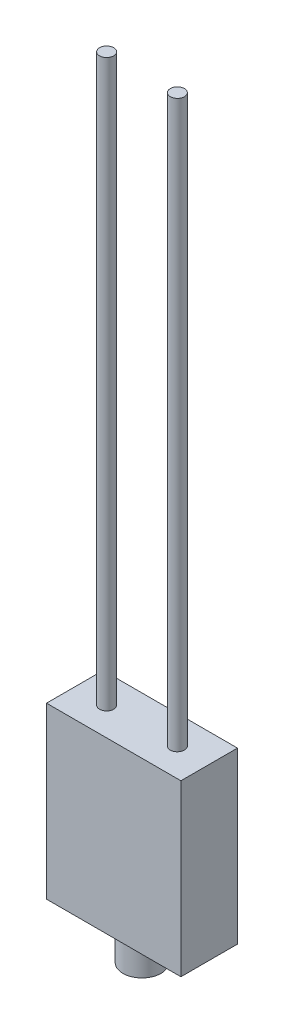
ISO-10303-21;
HEADER;
FILE_DESCRIPTION(('STEP AP214'),'2;1');
FILE_NAME('part.step','',(''),(''),'','','');
FILE_SCHEMA(('AUTOMOTIVE_DESIGN { 1 0 10303 214 1 1 1 1 }'));
ENDSEC;
DATA;
#1=APPLICATION_CONTEXT('core data for automotive mechanical design processes');
#2=APPLICATION_PROTOCOL_DEFINITION('international standard','automotive_design',2000,#1);
#3=PRODUCT_CONTEXT('',#1,'mechanical');
#4=PRODUCT('Part','Part','',(#3));
#5=PRODUCT_RELATED_PRODUCT_CATEGORY('part','',(#4));
#6=PRODUCT_DEFINITION_FORMATION('','',#4);
#7=PRODUCT_DEFINITION_CONTEXT('part definition',#1,'design');
#8=PRODUCT_DEFINITION('design','',#6,#7);
#9=PRODUCT_DEFINITION_SHAPE('','',#8);
#10=(LENGTH_UNIT() NAMED_UNIT(*) SI_UNIT(.MILLI.,.METRE.));
#11=(NAMED_UNIT(*) PLANE_ANGLE_UNIT() SI_UNIT($,.RADIAN.));
#12=(NAMED_UNIT(*) SI_UNIT($,.STERADIAN.) SOLID_ANGLE_UNIT());
#13=UNCERTAINTY_MEASURE_WITH_UNIT(LENGTH_MEASURE(1.E-05),#10,'distance_accuracy_value','');
#14=(GEOMETRIC_REPRESENTATION_CONTEXT(3) GLOBAL_UNCERTAINTY_ASSIGNED_CONTEXT((#13)) GLOBAL_UNIT_ASSIGNED_CONTEXT((#10,
#11,#12)) REPRESENTATION_CONTEXT('',''));
#15=CARTESIAN_POINT('',(0.,0.,0.));
#16=DIRECTION('',(0.,0.,1.));
#17=DIRECTION('',(1.,0.,0.));
#18=AXIS2_PLACEMENT_3D('',#15,#16,#17);
#19=CARTESIAN_POINT('',(9.5,24.,-4.));
#20=DIRECTION('',(-1.,0.,0.));
#21=DIRECTION('',(0.,0.,1.));
#22=AXIS2_PLACEMENT_3D('',#19,#20,#21);
#23=PLANE('',#22);
#24=DIRECTION('',(0.,0.,-1.));
#25=VECTOR('',#24,1.);
#26=CARTESIAN_POINT('',(9.5,0.,-4.));
#27=LINE('',#26,#25);
#28=CARTESIAN_POINT('',(9.5,0.,4.));
#29=VERTEX_POINT('',#28);
#30=CARTESIAN_POINT('',(9.5,0.,-4.));
#31=VERTEX_POINT('',#30);
#32=EDGE_CURVE('E100',#29,#31,#27,.T.);
#33=ORIENTED_EDGE('',*,*,#32,.T.);
#34=DIRECTION('',(0.,-1.,0.));
#35=VECTOR('',#34,1.);
#36=CARTESIAN_POINT('',(9.5,24.,-4.));
#37=LINE('',#36,#35);
#38=CARTESIAN_POINT('',(9.5,24.,-4.));
#39=VERTEX_POINT('',#38);
#40=EDGE_CURVE('E37',#39,#31,#37,.T.);
#41=ORIENTED_EDGE('',*,*,#40,.F.);
#42=DIRECTION('',(0.,0.,-1.));
#43=VECTOR('',#42,1.);
#44=CARTESIAN_POINT('',(9.5,24.,-4.));
#45=LINE('',#44,#43);
#46=CARTESIAN_POINT('',(9.5,24.,4.));
#47=VERTEX_POINT('',#46);
#48=EDGE_CURVE('E87',#47,#39,#45,.T.);
#49=ORIENTED_EDGE('',*,*,#48,.F.);
#50=DIRECTION('',(0.,-1.,0.));
#51=VECTOR('',#50,1.);
#52=CARTESIAN_POINT('',(9.5,24.,4.));
#53=LINE('',#52,#51);
#54=EDGE_CURVE('E96',#47,#29,#53,.T.);
#55=ORIENTED_EDGE('',*,*,#54,.T.);
#56=EDGE_LOOP('',(#33,#41,#49,#55));
#57=FACE_BOUND('',#56,.T.);
#58=ADVANCED_FACE('F34',(#57),#23,.F.);
#59=CARTESIAN_POINT('',(-9.5,24.,-4.));
#60=DIRECTION('',(0.,0.,1.));
#61=DIRECTION('',(1.,0.,0.));
#62=AXIS2_PLACEMENT_3D('',#59,#60,#61);
#63=PLANE('',#62);
#64=DIRECTION('',(-1.,0.,0.));
#65=VECTOR('',#64,1.);
#66=CARTESIAN_POINT('',(-9.5,0.,-4.));
#67=LINE('',#66,#65);
#68=CARTESIAN_POINT('',(-9.5,0.,-4.));
#69=VERTEX_POINT('',#68);
#70=EDGE_CURVE('E92',#31,#69,#67,.T.);
#71=ORIENTED_EDGE('',*,*,#70,.T.);
#72=DIRECTION('',(0.,-1.,0.));
#73=VECTOR('',#72,1.);
#74=CARTESIAN_POINT('',(-9.5,24.,-4.));
#75=LINE('',#74,#73);
#76=CARTESIAN_POINT('',(-9.5,24.,-4.));
#77=VERTEX_POINT('',#76);
#78=EDGE_CURVE('E90',#77,#69,#75,.T.);
#79=ORIENTED_EDGE('',*,*,#78,.F.);
#80=DIRECTION('',(-1.,0.,0.));
#81=VECTOR('',#80,1.);
#82=CARTESIAN_POINT('',(-9.5,24.,-4.));
#83=LINE('',#82,#81);
#84=EDGE_CURVE('E82',#39,#77,#83,.T.);
#85=ORIENTED_EDGE('',*,*,#84,.F.);
#86=ORIENTED_EDGE('',*,*,#40,.T.);
#87=EDGE_LOOP('',(#71,#79,#85,#86));
#88=FACE_BOUND('',#87,.T.);
#89=ADVANCED_FACE('F91',(#88),#63,.F.);
#90=CARTESIAN_POINT('',(-9.5,24.,-4.));
#91=DIRECTION('',(1.,0.,0.));
#92=DIRECTION('',(0.,0.,-1.));
#93=AXIS2_PLACEMENT_3D('',#90,#91,#92);
#94=PLANE('',#93);
#95=DIRECTION('',(0.,0.,1.));
#96=VECTOR('',#95,1.);
#97=CARTESIAN_POINT('',(-9.5,0.,-4.));
#98=LINE('',#97,#96);
#99=CARTESIAN_POINT('',(-9.5,0.,4.));
#100=VERTEX_POINT('',#99);
#101=EDGE_CURVE('E68',#69,#100,#98,.T.);
#102=ORIENTED_EDGE('',*,*,#101,.T.);
#103=DIRECTION('',(0.,-1.,0.));
#104=VECTOR('',#103,1.);
#105=CARTESIAN_POINT('',(-9.5,24.,4.));
#106=LINE('',#105,#104);
#107=CARTESIAN_POINT('',(-9.5,24.,4.));
#108=VERTEX_POINT('',#107);
#109=EDGE_CURVE('E93',#108,#100,#106,.T.);
#110=ORIENTED_EDGE('',*,*,#109,.F.);
#111=DIRECTION('',(0.,0.,1.));
#112=VECTOR('',#111,1.);
#113=CARTESIAN_POINT('',(-9.5,24.,-4.));
#114=LINE('',#113,#112);
#115=EDGE_CURVE('E85',#77,#108,#114,.T.);
#116=ORIENTED_EDGE('',*,*,#115,.F.);
#117=ORIENTED_EDGE('',*,*,#78,.T.);
#118=EDGE_LOOP('',(#102,#110,#116,#117));
#119=FACE_BOUND('',#118,.T.);
#120=ADVANCED_FACE('F94',(#119),#94,.F.);
#121=CARTESIAN_POINT('',(-9.5,24.,4.));
#122=DIRECTION('',(0.,0.,-1.));
#123=DIRECTION('',(-1.,0.,0.));
#124=AXIS2_PLACEMENT_3D('',#121,#122,#123);
#125=PLANE('',#124);
#126=DIRECTION('',(1.,0.,0.));
#127=VECTOR('',#126,1.);
#128=CARTESIAN_POINT('',(-9.5,0.,4.));
#129=LINE('',#128,#127);
#130=EDGE_CURVE('E74',#100,#29,#129,.T.);
#131=ORIENTED_EDGE('',*,*,#130,.T.);
#132=ORIENTED_EDGE('',*,*,#54,.F.);
#133=DIRECTION('',(1.,0.,0.));
#134=VECTOR('',#133,1.);
#135=CARTESIAN_POINT('',(-9.5,24.,4.));
#136=LINE('',#135,#134);
#137=EDGE_CURVE('E51',#108,#47,#136,.T.);
#138=ORIENTED_EDGE('',*,*,#137,.F.);
#139=ORIENTED_EDGE('',*,*,#109,.T.);
#140=EDGE_LOOP('',(#131,#132,#138,#139));
#141=FACE_BOUND('',#140,.T.);
#142=ADVANCED_FACE('F108',(#141),#125,.F.);
#143=CARTESIAN_POINT('',(0.,24.,0.));
#144=DIRECTION('',(0.,1.,0.));
#145=DIRECTION('',(0.,0.,1.));
#146=AXIS2_PLACEMENT_3D('',#143,#144,#145);
#147=PLANE('',#146);
#148=CARTESIAN_POINT('',(-5.,24.,0.));
#149=DIRECTION('',(0.,1.,0.));
#150=DIRECTION('',(0.,0.,-1.));
#151=AXIS2_PLACEMENT_3D('',#148,#149,#150);
#152=CIRCLE('',#151,1.);
#153=CARTESIAN_POINT('',(-5.,24.,-1.));
#154=VERTEX_POINT('',#153);
#155=EDGE_CURVE('E120',#154,#154,#152,.T.);
#156=ORIENTED_EDGE('',*,*,#155,.F.);
#157=EDGE_LOOP('',(#156));
#158=FACE_BOUND('',#157,.T.);
#159=CARTESIAN_POINT('',(5.,24.,0.));
#160=DIRECTION('',(0.,1.,0.));
#161=DIRECTION('',(0.,0.,1.));
#162=AXIS2_PLACEMENT_3D('',#159,#160,#161);
#163=CIRCLE('',#162,1.);
#164=CARTESIAN_POINT('',(5.,24.,1.));
#165=VERTEX_POINT('',#164);
#166=EDGE_CURVE('E114',#165,#165,#163,.T.);
#167=ORIENTED_EDGE('',*,*,#166,.F.);
#168=EDGE_LOOP('',(#167));
#169=FACE_BOUND('',#168,.T.);
#170=ORIENTED_EDGE('',*,*,#48,.T.);
#171=ORIENTED_EDGE('',*,*,#84,.T.);
#172=ORIENTED_EDGE('',*,*,#115,.T.);
#173=ORIENTED_EDGE('',*,*,#137,.T.);
#174=EDGE_LOOP('',(#170,#171,#172,#173));
#175=FACE_BOUND('',#174,.T.);
#176=ADVANCED_FACE('F83',(#158,#169,#175),#147,.T.);
#177=CARTESIAN_POINT('',(0.,0.,0.));
#178=DIRECTION('',(0.,1.,0.));
#179=DIRECTION('',(0.,0.,1.));
#180=AXIS2_PLACEMENT_3D('',#177,#178,#179);
#181=PLANE('',#180);
#182=CARTESIAN_POINT('',(0.,0.,0.));
#183=DIRECTION('',(0.,-1.,0.));
#184=DIRECTION('',(0.,0.,-1.));
#185=AXIS2_PLACEMENT_3D('',#182,#183,#184);
#186=CIRCLE('',#185,2.68610228276834);
#187=CARTESIAN_POINT('',(0.,0.,-2.68610228276834));
#188=VERTEX_POINT('',#187);
#189=EDGE_CURVE('E11',#188,#188,#186,.T.);
#190=ORIENTED_EDGE('',*,*,#189,.F.);
#191=EDGE_LOOP('',(#190));
#192=FACE_BOUND('',#191,.T.);
#193=ORIENTED_EDGE('',*,*,#32,.F.);
#194=ORIENTED_EDGE('',*,*,#130,.F.);
#195=ORIENTED_EDGE('',*,*,#101,.F.);
#196=ORIENTED_EDGE('',*,*,#70,.F.);
#197=EDGE_LOOP('',(#193,#194,#195,#196));
#198=FACE_BOUND('',#197,.T.);
#199=ADVANCED_FACE('F111',(#192,#198),#181,.F.);
#200=CARTESIAN_POINT('',(5.,104.,0.));
#201=DIRECTION('',(0.,-1.,0.));
#202=DIRECTION('',(0.,0.,-1.));
#203=AXIS2_PLACEMENT_3D('',#200,#201,#202);
#204=CYLINDRICAL_SURFACE('',#203,1.);
#205=CARTESIAN_POINT('',(5.,104.,0.));
#206=DIRECTION('',(0.,1.,0.));
#207=DIRECTION('',(0.,0.,1.));
#208=AXIS2_PLACEMENT_3D('',#205,#206,#207);
#209=CIRCLE('',#208,1.);
#210=CARTESIAN_POINT('',(5.,104.,1.));
#211=VERTEX_POINT('',#210);
#212=EDGE_CURVE('E103',#211,#211,#209,.T.);
#213=ORIENTED_EDGE('',*,*,#212,.F.);
#214=EDGE_LOOP('',(#213));
#215=FACE_BOUND('',#214,.T.);
#216=ORIENTED_EDGE('',*,*,#166,.T.);
#217=EDGE_LOOP('',(#216));
#218=FACE_BOUND('',#217,.T.);
#219=ADVANCED_FACE('F139',(#215,#218),#204,.T.);
#220=CARTESIAN_POINT('',(5.,104.,0.));
#221=DIRECTION('',(0.,1.,0.));
#222=DIRECTION('',(0.,0.,1.));
#223=AXIS2_PLACEMENT_3D('',#220,#221,#222);
#224=PLANE('',#223);
#225=ORIENTED_EDGE('',*,*,#212,.T.);
#226=EDGE_LOOP('',(#225));
#227=FACE_BOUND('',#226,.T.);
#228=ADVANCED_FACE('F145',(#227),#224,.T.);
#229=CARTESIAN_POINT('',(-5.,104.,0.));
#230=DIRECTION('',(0.,-1.,0.));
#231=DIRECTION('',(0.,0.,-1.));
#232=AXIS2_PLACEMENT_3D('',#229,#230,#231);
#233=CYLINDRICAL_SURFACE('',#232,1.);
#234=CARTESIAN_POINT('',(-5.,104.,0.));
#235=DIRECTION('',(0.,1.,0.));
#236=DIRECTION('',(0.,0.,-1.));
#237=AXIS2_PLACEMENT_3D('',#234,#235,#236);
#238=CIRCLE('',#237,1.);
#239=CARTESIAN_POINT('',(-5.,104.,-1.));
#240=VERTEX_POINT('',#239);
#241=EDGE_CURVE('E117',#240,#240,#238,.T.);
#242=ORIENTED_EDGE('',*,*,#241,.F.);
#243=EDGE_LOOP('',(#242));
#244=FACE_BOUND('',#243,.T.);
#245=ORIENTED_EDGE('',*,*,#155,.T.);
#246=EDGE_LOOP('',(#245));
#247=FACE_BOUND('',#246,.T.);
#248=ADVANCED_FACE('F184',(#244,#247),#233,.T.);
#249=CARTESIAN_POINT('',(-5.,104.,0.));
#250=DIRECTION('',(0.,-1.,0.));
#251=DIRECTION('',(0.,0.,-1.));
#252=AXIS2_PLACEMENT_3D('',#249,#250,#251);
#253=PLANE('',#252);
#254=ORIENTED_EDGE('',*,*,#241,.T.);
#255=EDGE_LOOP('',(#254));
#256=FACE_BOUND('',#255,.T.);
#257=ADVANCED_FACE('F134',(#256),#253,.F.);
#258=CARTESIAN_POINT('',(0.,-5.,0.));
#259=DIRECTION('',(0.,1.,0.));
#260=DIRECTION('',(0.,0.,1.));
#261=AXIS2_PLACEMENT_3D('',#258,#259,#260);
#262=CYLINDRICAL_SURFACE('',#261,2.68610228276834);
#263=CARTESIAN_POINT('',(0.,-5.,0.));
#264=DIRECTION('',(0.,-1.,0.));
#265=DIRECTION('',(0.,0.,-1.));
#266=AXIS2_PLACEMENT_3D('',#263,#264,#265);
#267=CIRCLE('',#266,2.68610228276834);
#268=CARTESIAN_POINT('',(0.,-5.,-2.68610228276834));
#269=VERTEX_POINT('',#268);
#270=EDGE_CURVE('E123',#269,#269,#267,.T.);
#271=ORIENTED_EDGE('',*,*,#270,.F.);
#272=EDGE_LOOP('',(#271));
#273=FACE_BOUND('',#272,.T.);
#274=ORIENTED_EDGE('',*,*,#189,.T.);
#275=EDGE_LOOP('',(#274));
#276=FACE_BOUND('',#275,.T.);
#277=ADVANCED_FACE('F131',(#273,#276),#262,.T.);
#278=CARTESIAN_POINT('',(0.,-5.,0.));
#279=DIRECTION('',(0.,-1.,0.));
#280=DIRECTION('',(0.,0.,-1.));
#281=AXIS2_PLACEMENT_3D('',#278,#279,#280);
#282=PLANE('',#281);
#283=ORIENTED_EDGE('',*,*,#270,.T.);
#284=EDGE_LOOP('',(#283));
#285=FACE_BOUND('',#284,.T.);
#286=ADVANCED_FACE('F129',(#285),#282,.T.);
#287=CLOSED_SHELL('',(#58,#89,#120,#142,#176,#199,#219,#228,#248,#257,#277,#286));
#288=MANIFOLD_SOLID_BREP('B2',#287);
#289=ADVANCED_BREP_SHAPE_REPRESENTATION('',(#18,#288),#14);
#290=SHAPE_DEFINITION_REPRESENTATION(#9,#289);
ENDSEC;
END-ISO-10303-21;
